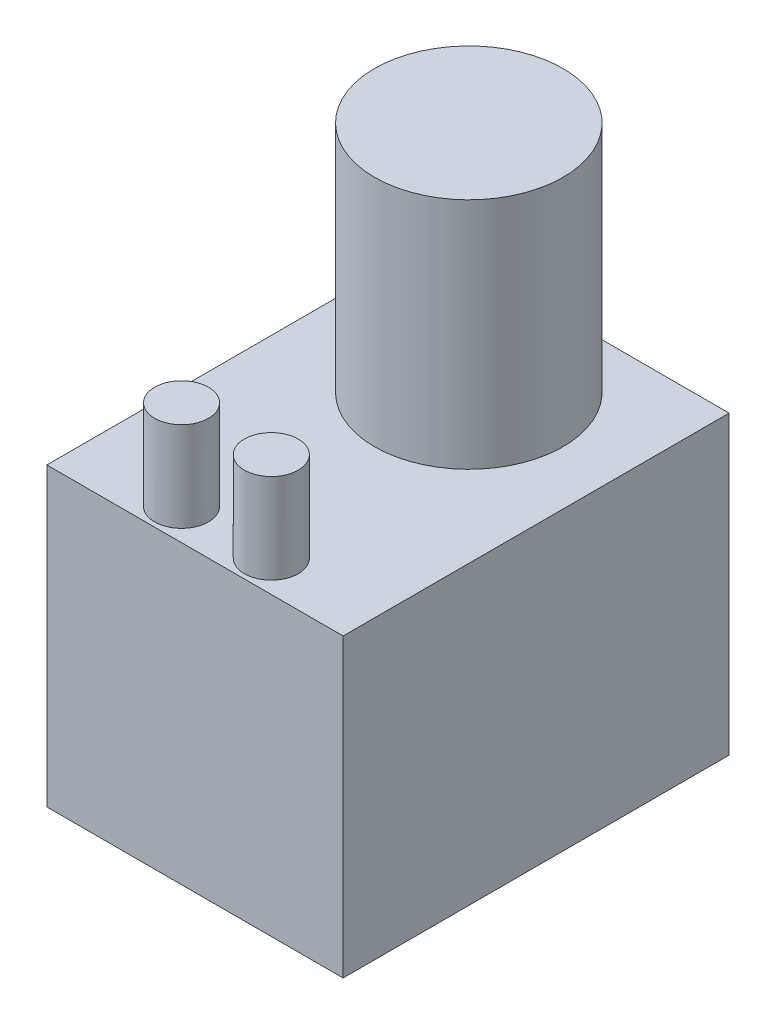
ISO-10303-21;
HEADER;
FILE_DESCRIPTION(('STEP AP214'),'2;1');
FILE_NAME('part.step','',(''),(''),'','','');
FILE_SCHEMA(('AUTOMOTIVE_DESIGN { 1 0 10303 214 1 1 1 1 }'));
ENDSEC;
DATA;
#1=APPLICATION_CONTEXT('core data for automotive mechanical design processes');
#2=APPLICATION_PROTOCOL_DEFINITION('international standard','automotive_design',2000,#1);
#3=PRODUCT_CONTEXT('',#1,'mechanical');
#4=PRODUCT('Part','Part','',(#3));
#5=PRODUCT_RELATED_PRODUCT_CATEGORY('part','',(#4));
#6=PRODUCT_DEFINITION_FORMATION('','',#4);
#7=PRODUCT_DEFINITION_CONTEXT('part definition',#1,'design');
#8=PRODUCT_DEFINITION('design','',#6,#7);
#9=PRODUCT_DEFINITION_SHAPE('','',#8);
#10=(LENGTH_UNIT() NAMED_UNIT(*) SI_UNIT(.MILLI.,.METRE.));
#11=(NAMED_UNIT(*) PLANE_ANGLE_UNIT() SI_UNIT($,.RADIAN.));
#12=(NAMED_UNIT(*) SI_UNIT($,.STERADIAN.) SOLID_ANGLE_UNIT());
#13=UNCERTAINTY_MEASURE_WITH_UNIT(LENGTH_MEASURE(1.E-05),#10,'distance_accuracy_value','');
#14=(GEOMETRIC_REPRESENTATION_CONTEXT(3) GLOBAL_UNCERTAINTY_ASSIGNED_CONTEXT((#13)) GLOBAL_UNIT_ASSIGNED_CONTEXT((#10,
#11,#12)) REPRESENTATION_CONTEXT('',''));
#15=CARTESIAN_POINT('',(0.,0.,0.));
#16=DIRECTION('',(0.,0.,1.));
#17=DIRECTION('',(1.,0.,0.));
#18=AXIS2_PLACEMENT_3D('',#15,#16,#17);
#19=CARTESIAN_POINT('',(33.,33.,86.));
#20=DIRECTION('',(-1.,0.,0.));
#21=DIRECTION('',(0.,-1.,0.));
#22=AXIS2_PLACEMENT_3D('',#19,#20,#21);
#23=PLANE('',#22);
#24=DIRECTION('',(0.,1.,0.));
#25=VECTOR('',#24,1.);
#26=CARTESIAN_POINT('',(33.,33.,0.));
#27=LINE('',#26,#25);
#28=CARTESIAN_POINT('',(33.,-33.,0.));
#29=VERTEX_POINT('',#28);
#30=CARTESIAN_POINT('',(33.,33.,0.));
#31=VERTEX_POINT('',#30);
#32=EDGE_CURVE('E103',#29,#31,#27,.T.);
#33=ORIENTED_EDGE('',*,*,#32,.T.);
#34=DIRECTION('',(0.,0.,-1.));
#35=VECTOR('',#34,1.);
#36=CARTESIAN_POINT('',(33.,33.,86.));
#37=LINE('',#36,#35);
#38=CARTESIAN_POINT('',(33.,33.,86.));
#39=VERTEX_POINT('',#38);
#40=EDGE_CURVE('E94',#39,#31,#37,.T.);
#41=ORIENTED_EDGE('',*,*,#40,.F.);
#42=DIRECTION('',(0.,1.,0.));
#43=VECTOR('',#42,1.);
#44=CARTESIAN_POINT('',(33.,33.,86.));
#45=LINE('',#44,#43);
#46=CARTESIAN_POINT('',(33.,-33.,86.));
#47=VERTEX_POINT('',#46);
#48=EDGE_CURVE('E88',#47,#39,#45,.T.);
#49=ORIENTED_EDGE('',*,*,#48,.F.);
#50=DIRECTION('',(0.,0.,-1.));
#51=VECTOR('',#50,1.);
#52=CARTESIAN_POINT('',(33.,-33.,86.));
#53=LINE('',#52,#51);
#54=EDGE_CURVE('E99',#47,#29,#53,.T.);
#55=ORIENTED_EDGE('',*,*,#54,.T.);
#56=EDGE_LOOP('',(#33,#41,#49,#55));
#57=FACE_BOUND('',#56,.T.);
#58=ADVANCED_FACE('F36',(#57),#23,.F.);
#59=CARTESIAN_POINT('',(-33.,33.,86.));
#60=DIRECTION('',(0.,-1.,0.));
#61=DIRECTION('',(0.,0.,-1.));
#62=AXIS2_PLACEMENT_3D('',#59,#60,#61);
#63=PLANE('',#62);
#64=CARTESIAN_POINT('',(10.,33.,79.));
#65=DIRECTION('',(0.,-1.,0.));
#66=DIRECTION('',(0.,0.,-1.));
#67=AXIS2_PLACEMENT_3D('',#64,#65,#66);
#68=CIRCLE('',#67,6.);
#69=CARTESIAN_POINT('',(10.,33.,73.));
#70=VERTEX_POINT('',#69);
#71=EDGE_CURVE('E11',#70,#70,#68,.F.);
#72=ORIENTED_EDGE('',*,*,#71,.F.);
#73=EDGE_LOOP('',(#72));
#74=FACE_BOUND('',#73,.T.);
#75=CARTESIAN_POINT('',(-10.,33.,79.));
#76=DIRECTION('',(0.,-1.,0.));
#77=DIRECTION('',(0.,0.,-1.));
#78=AXIS2_PLACEMENT_3D('',#75,#76,#77);
#79=CIRCLE('',#78,6.00000000000001);
#80=CARTESIAN_POINT('',(-10.,33.,73.));
#81=VERTEX_POINT('',#80);
#82=EDGE_CURVE('E44',#81,#81,#79,.F.);
#83=ORIENTED_EDGE('',*,*,#82,.F.);
#84=EDGE_LOOP('',(#83));
#85=FACE_BOUND('',#84,.T.);
#86=CARTESIAN_POINT('',(0.,33.,25.));
#87=DIRECTION('',(0.,1.,0.));
#88=DIRECTION('',(0.,0.,1.));
#89=AXIS2_PLACEMENT_3D('',#86,#87,#88);
#90=CIRCLE('',#89,21.);
#91=CARTESIAN_POINT('',(0.,33.,46.));
#92=VERTEX_POINT('',#91);
#93=EDGE_CURVE('E112',#92,#92,#90,.T.);
#94=ORIENTED_EDGE('',*,*,#93,.F.);
#95=EDGE_LOOP('',(#94));
#96=FACE_BOUND('',#95,.T.);
#97=DIRECTION('',(-1.,0.,0.));
#98=VECTOR('',#97,1.);
#99=CARTESIAN_POINT('',(-33.,33.,0.));
#100=LINE('',#99,#98);
#101=CARTESIAN_POINT('',(-33.,33.,0.));
#102=VERTEX_POINT('',#101);
#103=EDGE_CURVE('E93',#31,#102,#100,.T.);
#104=ORIENTED_EDGE('',*,*,#103,.T.);
#105=DIRECTION('',(0.,0.,-1.));
#106=VECTOR('',#105,1.);
#107=CARTESIAN_POINT('',(-33.,33.,86.));
#108=LINE('',#107,#106);
#109=CARTESIAN_POINT('',(-33.,33.,86.));
#110=VERTEX_POINT('',#109);
#111=EDGE_CURVE('E91',#110,#102,#108,.T.);
#112=ORIENTED_EDGE('',*,*,#111,.F.);
#113=DIRECTION('',(-1.,0.,0.));
#114=VECTOR('',#113,1.);
#115=CARTESIAN_POINT('',(-33.,33.,86.));
#116=LINE('',#115,#114);
#117=EDGE_CURVE('E83',#39,#110,#116,.T.);
#118=ORIENTED_EDGE('',*,*,#117,.F.);
#119=ORIENTED_EDGE('',*,*,#40,.T.);
#120=EDGE_LOOP('',(#104,#112,#118,#119));
#121=FACE_BOUND('',#120,.T.);
#122=ADVANCED_FACE('F92',(#74,#85,#96,#121),#63,.F.);
#123=CARTESIAN_POINT('',(-33.,33.,86.));
#124=DIRECTION('',(1.,0.,0.));
#125=DIRECTION('',(0.,1.,0.));
#126=AXIS2_PLACEMENT_3D('',#123,#124,#125);
#127=PLANE('',#126);
#128=DIRECTION('',(0.,-1.,0.));
#129=VECTOR('',#128,1.);
#130=CARTESIAN_POINT('',(-33.,33.,0.));
#131=LINE('',#130,#129);
#132=CARTESIAN_POINT('',(-33.,-33.,0.));
#133=VERTEX_POINT('',#132);
#134=EDGE_CURVE('E69',#102,#133,#131,.T.);
#135=ORIENTED_EDGE('',*,*,#134,.T.);
#136=DIRECTION('',(0.,0.,-1.));
#137=VECTOR('',#136,1.);
#138=CARTESIAN_POINT('',(-33.,-33.,86.));
#139=LINE('',#138,#137);
#140=CARTESIAN_POINT('',(-33.,-33.,86.));
#141=VERTEX_POINT('',#140);
#142=EDGE_CURVE('E95',#141,#133,#139,.T.);
#143=ORIENTED_EDGE('',*,*,#142,.F.);
#144=DIRECTION('',(0.,-1.,0.));
#145=VECTOR('',#144,1.);
#146=CARTESIAN_POINT('',(-33.,33.,86.));
#147=LINE('',#146,#145);
#148=EDGE_CURVE('E86',#110,#141,#147,.T.);
#149=ORIENTED_EDGE('',*,*,#148,.F.);
#150=ORIENTED_EDGE('',*,*,#111,.T.);
#151=EDGE_LOOP('',(#135,#143,#149,#150));
#152=FACE_BOUND('',#151,.T.);
#153=ADVANCED_FACE('F97',(#152),#127,.F.);
#154=CARTESIAN_POINT('',(-33.,-33.,86.));
#155=DIRECTION('',(0.,1.,0.));
#156=DIRECTION('',(0.,0.,1.));
#157=AXIS2_PLACEMENT_3D('',#154,#155,#156);
#158=PLANE('',#157);
#159=DIRECTION('',(1.,0.,0.));
#160=VECTOR('',#159,1.);
#161=CARTESIAN_POINT('',(-33.,-33.,0.));
#162=LINE('',#161,#160);
#163=EDGE_CURVE('E75',#133,#29,#162,.T.);
#164=ORIENTED_EDGE('',*,*,#163,.T.);
#165=ORIENTED_EDGE('',*,*,#54,.F.);
#166=DIRECTION('',(1.,0.,0.));
#167=VECTOR('',#166,1.);
#168=CARTESIAN_POINT('',(-33.,-33.,86.));
#169=LINE('',#168,#167);
#170=EDGE_CURVE('E52',#141,#47,#169,.T.);
#171=ORIENTED_EDGE('',*,*,#170,.F.);
#172=ORIENTED_EDGE('',*,*,#142,.T.);
#173=EDGE_LOOP('',(#164,#165,#171,#172));
#174=FACE_BOUND('',#173,.T.);
#175=ADVANCED_FACE('F146',(#174),#158,.F.);
#176=CARTESIAN_POINT('',(0.,0.,86.));
#177=DIRECTION('',(0.,0.,1.));
#178=DIRECTION('',(1.,0.,0.));
#179=AXIS2_PLACEMENT_3D('',#176,#177,#178);
#180=PLANE('',#179);
#181=ORIENTED_EDGE('',*,*,#48,.T.);
#182=ORIENTED_EDGE('',*,*,#117,.T.);
#183=ORIENTED_EDGE('',*,*,#148,.T.);
#184=ORIENTED_EDGE('',*,*,#170,.T.);
#185=EDGE_LOOP('',(#181,#182,#183,#184));
#186=FACE_BOUND('',#185,.T.);
#187=ADVANCED_FACE('F84',(#186),#180,.T.);
#188=CARTESIAN_POINT('',(0.,0.,0.));
#189=DIRECTION('',(0.,0.,1.));
#190=DIRECTION('',(1.,0.,0.));
#191=AXIS2_PLACEMENT_3D('',#188,#189,#190);
#192=PLANE('',#191);
#193=ORIENTED_EDGE('',*,*,#32,.F.);
#194=ORIENTED_EDGE('',*,*,#163,.F.);
#195=ORIENTED_EDGE('',*,*,#134,.F.);
#196=ORIENTED_EDGE('',*,*,#103,.F.);
#197=EDGE_LOOP('',(#193,#194,#195,#196));
#198=FACE_BOUND('',#197,.T.);
#199=ADVANCED_FACE('F152',(#198),#192,.F.);
#200=CARTESIAN_POINT('',(0.,85.,25.));
#201=DIRECTION('',(0.,-1.,0.));
#202=DIRECTION('',(0.,0.,-1.));
#203=AXIS2_PLACEMENT_3D('',#200,#201,#202);
#204=CYLINDRICAL_SURFACE('',#203,21.);
#205=CARTESIAN_POINT('',(0.,85.,25.));
#206=DIRECTION('',(0.,1.,0.));
#207=DIRECTION('',(0.,0.,1.));
#208=AXIS2_PLACEMENT_3D('',#205,#206,#207);
#209=CIRCLE('',#208,21.);
#210=CARTESIAN_POINT('',(0.,85.,46.));
#211=VERTEX_POINT('',#210);
#212=EDGE_CURVE('E106',#211,#211,#209,.T.);
#213=ORIENTED_EDGE('',*,*,#212,.F.);
#214=EDGE_LOOP('',(#213));
#215=FACE_BOUND('',#214,.T.);
#216=ORIENTED_EDGE('',*,*,#93,.T.);
#217=EDGE_LOOP('',(#216));
#218=FACE_BOUND('',#217,.T.);
#219=ADVANCED_FACE('F155',(#215,#218),#204,.T.);
#220=CARTESIAN_POINT('',(0.,85.,25.));
#221=DIRECTION('',(0.,1.,0.));
#222=DIRECTION('',(0.,0.,1.));
#223=AXIS2_PLACEMENT_3D('',#220,#221,#222);
#224=PLANE('',#223);
#225=ORIENTED_EDGE('',*,*,#212,.T.);
#226=EDGE_LOOP('',(#225));
#227=FACE_BOUND('',#226,.T.);
#228=ADVANCED_FACE('F161',(#227),#224,.T.);
#229=CARTESIAN_POINT('',(-10.,53.,79.));
#230=DIRECTION('',(0.,-1.,0.));
#231=DIRECTION('',(0.,0.,-1.));
#232=AXIS2_PLACEMENT_3D('',#229,#230,#231);
#233=CYLINDRICAL_SURFACE('',#232,6.00000000000001);
#234=CARTESIAN_POINT('',(-10.,53.,79.));
#235=DIRECTION('',(0.,1.,0.));
#236=DIRECTION('',(0.,0.,1.));
#237=AXIS2_PLACEMENT_3D('',#234,#235,#236);
#238=CIRCLE('',#237,6.00000000000001);
#239=CARTESIAN_POINT('',(-10.,53.,85.));
#240=VERTEX_POINT('',#239);
#241=EDGE_CURVE('E123',#240,#240,#238,.T.);
#242=ORIENTED_EDGE('',*,*,#241,.F.);
#243=EDGE_LOOP('',(#242));
#244=FACE_BOUND('',#243,.T.);
#245=ORIENTED_EDGE('',*,*,#82,.T.);
#246=EDGE_LOOP('',(#245));
#247=FACE_BOUND('',#246,.T.);
#248=ADVANCED_FACE('F165',(#244,#247),#233,.T.);
#249=CARTESIAN_POINT('',(-10.,53.,79.));
#250=DIRECTION('',(0.,1.,0.));
#251=DIRECTION('',(0.,0.,1.));
#252=AXIS2_PLACEMENT_3D('',#249,#250,#251);
#253=PLANE('',#252);
#254=ORIENTED_EDGE('',*,*,#241,.T.);
#255=EDGE_LOOP('',(#254));
#256=FACE_BOUND('',#255,.T.);
#257=ADVANCED_FACE('F135',(#256),#253,.T.);
#258=CARTESIAN_POINT('',(10.,53.,79.));
#259=DIRECTION('',(0.,-1.,0.));
#260=DIRECTION('',(0.,0.,-1.));
#261=AXIS2_PLACEMENT_3D('',#258,#259,#260);
#262=CYLINDRICAL_SURFACE('',#261,6.);
#263=CARTESIAN_POINT('',(10.,53.,79.));
#264=DIRECTION('',(0.,1.,0.));
#265=DIRECTION('',(0.,0.,1.));
#266=AXIS2_PLACEMENT_3D('',#263,#264,#265);
#267=CIRCLE('',#266,6.);
#268=CARTESIAN_POINT('',(10.,53.,85.));
#269=VERTEX_POINT('',#268);
#270=EDGE_CURVE('E126',#269,#269,#267,.T.);
#271=ORIENTED_EDGE('',*,*,#270,.F.);
#272=EDGE_LOOP('',(#271));
#273=FACE_BOUND('',#272,.T.);
#274=ORIENTED_EDGE('',*,*,#71,.T.);
#275=EDGE_LOOP('',(#274));
#276=FACE_BOUND('',#275,.T.);
#277=ADVANCED_FACE('F132',(#273,#276),#262,.T.);
#278=CARTESIAN_POINT('',(10.,53.,79.));
#279=DIRECTION('',(0.,1.,0.));
#280=DIRECTION('',(0.,0.,1.));
#281=AXIS2_PLACEMENT_3D('',#278,#279,#280);
#282=PLANE('',#281);
#283=ORIENTED_EDGE('',*,*,#270,.T.);
#284=EDGE_LOOP('',(#283));
#285=FACE_BOUND('',#284,.T.);
#286=ADVANCED_FACE('F130',(#285),#282,.T.);
#287=CLOSED_SHELL('',(#58,#122,#153,#175,#187,#199,#219,#228,#248,#257,#277,#286));
#288=MANIFOLD_SOLID_BREP('B2',#287);
#289=ADVANCED_BREP_SHAPE_REPRESENTATION('',(#18,#288),#14);
#290=SHAPE_DEFINITION_REPRESENTATION(#9,#289);
ENDSEC;
END-ISO-10303-21;
